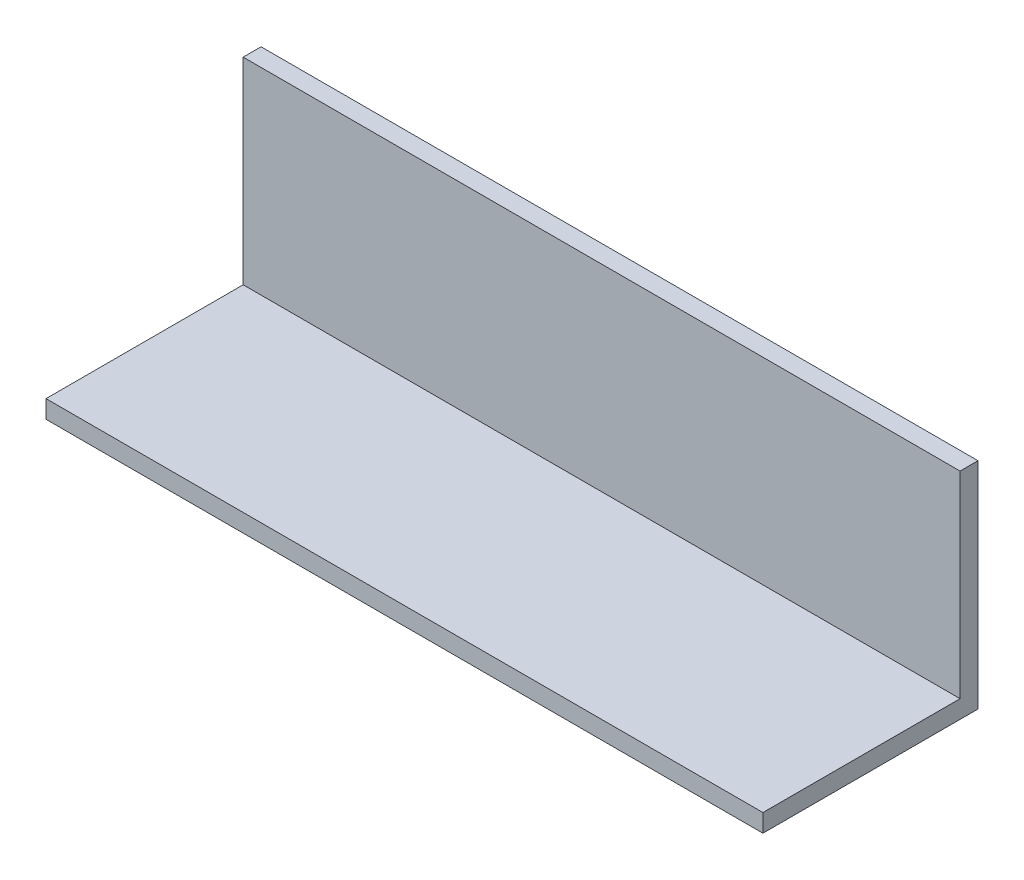
ISO-10303-21;
HEADER;
FILE_DESCRIPTION(('STEP AP214'),'2;1');
FILE_NAME('part.step','',(''),(''),'','','');
FILE_SCHEMA(('AUTOMOTIVE_DESIGN { 1 0 10303 214 1 1 1 1 }'));
ENDSEC;
DATA;
#1=APPLICATION_CONTEXT('core data for automotive mechanical design processes');
#2=APPLICATION_PROTOCOL_DEFINITION('international standard','automotive_design',2000,#1);
#3=PRODUCT_CONTEXT('',#1,'mechanical');
#4=PRODUCT('Part','Part','',(#3));
#5=PRODUCT_RELATED_PRODUCT_CATEGORY('part','',(#4));
#6=PRODUCT_DEFINITION_FORMATION('','',#4);
#7=PRODUCT_DEFINITION_CONTEXT('part definition',#1,'design');
#8=PRODUCT_DEFINITION('design','',#6,#7);
#9=PRODUCT_DEFINITION_SHAPE('','',#8);
#10=(LENGTH_UNIT() NAMED_UNIT(*) SI_UNIT(.MILLI.,.METRE.));
#11=(NAMED_UNIT(*) PLANE_ANGLE_UNIT() SI_UNIT($,.RADIAN.));
#12=(NAMED_UNIT(*) SI_UNIT($,.STERADIAN.) SOLID_ANGLE_UNIT());
#13=UNCERTAINTY_MEASURE_WITH_UNIT(LENGTH_MEASURE(1.E-05),#10,'distance_accuracy_value','');
#14=(GEOMETRIC_REPRESENTATION_CONTEXT(3) GLOBAL_UNCERTAINTY_ASSIGNED_CONTEXT((#13)) GLOBAL_UNIT_ASSIGNED_CONTEXT((#10,
#11,#12)) REPRESENTATION_CONTEXT('',''));
#15=CARTESIAN_POINT('',(0.,0.,0.));
#16=DIRECTION('',(0.,0.,1.));
#17=DIRECTION('',(1.,0.,0.));
#18=AXIS2_PLACEMENT_3D('',#15,#16,#17);
#19=CARTESIAN_POINT('',(-1.846,0.71175,38.1));
#20=DIRECTION('',(0.,-1.,0.));
#21=DIRECTION('',(0.,0.,-1.));
#22=AXIS2_PLACEMENT_3D('',#19,#20,#21);
#23=PLANE('',#22);
#24=DIRECTION('',(-1.,0.,0.));
#25=VECTOR('',#24,1.);
#26=CARTESIAN_POINT('',(-1.846,0.71175,3.175));
#27=LINE('',#26,#25);
#28=CARTESIAN_POINT('',(125.154,0.71175,3.175));
#29=VERTEX_POINT('',#28);
#30=CARTESIAN_POINT('',(-1.846,0.71175,3.175));
#31=VERTEX_POINT('',#30);
#32=EDGE_CURVE('E138',#29,#31,#27,.T.);
#33=ORIENTED_EDGE('',*,*,#32,.F.);
#34=DIRECTION('',(0.,0.,-1.));
#35=VECTOR('',#34,1.);
#36=CARTESIAN_POINT('',(125.154,0.71175,38.1));
#37=LINE('',#36,#35);
#38=CARTESIAN_POINT('',(125.154,0.71175,0.));
#39=VERTEX_POINT('',#38);
#40=EDGE_CURVE('E95',#29,#39,#37,.T.);
#41=ORIENTED_EDGE('',*,*,#40,.T.);
#42=DIRECTION('',(-1.,0.,0.));
#43=VECTOR('',#42,1.);
#44=CARTESIAN_POINT('',(-1.846,0.71175,0.));
#45=LINE('',#44,#43);
#46=CARTESIAN_POINT('',(-1.846,0.71175,0.));
#47=VERTEX_POINT('',#46);
#48=EDGE_CURVE('E99',#39,#47,#45,.T.);
#49=ORIENTED_EDGE('',*,*,#48,.T.);
#50=DIRECTION('',(0.,0.,-1.));
#51=VECTOR('',#50,1.);
#52=CARTESIAN_POINT('',(-1.846,0.71175,38.1));
#53=LINE('',#52,#51);
#54=EDGE_CURVE('E84',#31,#47,#53,.T.);
#55=ORIENTED_EDGE('',*,*,#54,.F.);
#56=EDGE_LOOP('',(#33,#41,#49,#55));
#57=FACE_BOUND('',#56,.T.);
#58=ADVANCED_FACE('F39',(#57),#23,.F.);
#59=CARTESIAN_POINT('',(-1.846,0.71175,38.1));
#60=DIRECTION('',(1.,0.,0.));
#61=DIRECTION('',(0.,1.,0.));
#62=AXIS2_PLACEMENT_3D('',#59,#60,#61);
#63=PLANE('',#62);
#64=DIRECTION('',(0.,-1.,0.));
#65=VECTOR('',#64,1.);
#66=CARTESIAN_POINT('',(-1.846,0.71175,38.1));
#67=LINE('',#66,#65);
#68=CARTESIAN_POINT('',(-1.846,-34.21325,38.1));
#69=VERTEX_POINT('',#68);
#70=CARTESIAN_POINT('',(-1.846,-37.38825,38.1));
#71=VERTEX_POINT('',#70);
#72=EDGE_CURVE('E105',#69,#71,#67,.T.);
#73=ORIENTED_EDGE('',*,*,#72,.F.);
#74=DIRECTION('',(0.,0.,1.));
#75=VECTOR('',#74,1.);
#76=CARTESIAN_POINT('',(-1.846,-34.21325,3.175));
#77=LINE('',#76,#75);
#78=CARTESIAN_POINT('',(-1.846,-34.21325,3.175));
#79=VERTEX_POINT('',#78);
#80=EDGE_CURVE('E55',#79,#69,#77,.T.);
#81=ORIENTED_EDGE('',*,*,#80,.F.);
#82=DIRECTION('',(0.,-1.,0.));
#83=VECTOR('',#82,1.);
#84=CARTESIAN_POINT('',(-1.846,0.71175,3.175));
#85=LINE('',#84,#83);
#86=EDGE_CURVE('E91',#31,#79,#85,.T.);
#87=ORIENTED_EDGE('',*,*,#86,.F.);
#88=ORIENTED_EDGE('',*,*,#54,.T.);
#89=DIRECTION('',(0.,-1.,0.));
#90=VECTOR('',#89,1.);
#91=CARTESIAN_POINT('',(-1.846,0.71175,0.));
#92=LINE('',#91,#90);
#93=CARTESIAN_POINT('',(-1.846,-37.38825,0.));
#94=VERTEX_POINT('',#93);
#95=EDGE_CURVE('E89',#47,#94,#92,.T.);
#96=ORIENTED_EDGE('',*,*,#95,.T.);
#97=DIRECTION('',(0.,0.,-1.));
#98=VECTOR('',#97,1.);
#99=CARTESIAN_POINT('',(-1.846,-37.38825,38.1));
#100=LINE('',#99,#98);
#101=EDGE_CURVE('E11',#71,#94,#100,.T.);
#102=ORIENTED_EDGE('',*,*,#101,.F.);
#103=EDGE_LOOP('',(#73,#81,#87,#88,#96,#102));
#104=FACE_BOUND('',#103,.T.);
#105=ADVANCED_FACE('F41',(#104),#63,.F.);
#106=CARTESIAN_POINT('',(-1.846,-37.38825,38.1));
#107=DIRECTION('',(0.,1.,0.));
#108=DIRECTION('',(0.,0.,1.));
#109=AXIS2_PLACEMENT_3D('',#106,#107,#108);
#110=PLANE('',#109);
#111=DIRECTION('',(1.,0.,0.));
#112=VECTOR('',#111,1.);
#113=CARTESIAN_POINT('',(-1.846,-37.38825,0.));
#114=LINE('',#113,#112);
#115=CARTESIAN_POINT('',(125.154,-37.38825,0.));
#116=VERTEX_POINT('',#115);
#117=EDGE_CURVE('E109',#94,#116,#114,.T.);
#118=ORIENTED_EDGE('',*,*,#117,.T.);
#119=DIRECTION('',(0.,0.,-1.));
#120=VECTOR('',#119,1.);
#121=CARTESIAN_POINT('',(125.154,-37.38825,38.1));
#122=LINE('',#121,#120);
#123=CARTESIAN_POINT('',(125.154,-37.38825,38.1));
#124=VERTEX_POINT('',#123);
#125=EDGE_CURVE('E48',#124,#116,#122,.T.);
#126=ORIENTED_EDGE('',*,*,#125,.F.);
#127=DIRECTION('',(1.,0.,0.));
#128=VECTOR('',#127,1.);
#129=CARTESIAN_POINT('',(-1.846,-37.38825,38.1));
#130=LINE('',#129,#128);
#131=EDGE_CURVE('E64',#71,#124,#130,.T.);
#132=ORIENTED_EDGE('',*,*,#131,.F.);
#133=ORIENTED_EDGE('',*,*,#101,.T.);
#134=EDGE_LOOP('',(#118,#126,#132,#133));
#135=FACE_BOUND('',#134,.T.);
#136=ADVANCED_FACE('F131',(#135),#110,.F.);
#137=CARTESIAN_POINT('',(125.154,0.71175,38.1));
#138=DIRECTION('',(-1.,0.,0.));
#139=DIRECTION('',(0.,0.,1.));
#140=AXIS2_PLACEMENT_3D('',#137,#138,#139);
#141=PLANE('',#140);
#142=DIRECTION('',(0.,1.,0.));
#143=VECTOR('',#142,1.);
#144=CARTESIAN_POINT('',(125.154,0.71175,3.175));
#145=LINE('',#144,#143);
#146=CARTESIAN_POINT('',(125.154,-34.21325,3.175));
#147=VERTEX_POINT('',#146);
#148=EDGE_CURVE('E146',#147,#29,#145,.T.);
#149=ORIENTED_EDGE('',*,*,#148,.F.);
#150=DIRECTION('',(0.,0.,1.));
#151=VECTOR('',#150,1.);
#152=CARTESIAN_POINT('',(125.154,-34.21325,3.175));
#153=LINE('',#152,#151);
#154=CARTESIAN_POINT('',(125.154,-34.21325,38.1));
#155=VERTEX_POINT('',#154);
#156=EDGE_CURVE('E111',#147,#155,#153,.T.);
#157=ORIENTED_EDGE('',*,*,#156,.T.);
#158=DIRECTION('',(0.,1.,0.));
#159=VECTOR('',#158,1.);
#160=CARTESIAN_POINT('',(125.154,0.71175,38.1));
#161=LINE('',#160,#159);
#162=EDGE_CURVE('E96',#124,#155,#161,.T.);
#163=ORIENTED_EDGE('',*,*,#162,.F.);
#164=ORIENTED_EDGE('',*,*,#125,.T.);
#165=DIRECTION('',(0.,1.,0.));
#166=VECTOR('',#165,1.);
#167=CARTESIAN_POINT('',(125.154,0.71175,0.));
#168=LINE('',#167,#166);
#169=EDGE_CURVE('E106',#116,#39,#168,.T.);
#170=ORIENTED_EDGE('',*,*,#169,.T.);
#171=ORIENTED_EDGE('',*,*,#40,.F.);
#172=EDGE_LOOP('',(#149,#157,#163,#164,#170,#171));
#173=FACE_BOUND('',#172,.T.);
#174=ADVANCED_FACE('F129',(#173),#141,.F.);
#175=CARTESIAN_POINT('',(0.,0.,38.1));
#176=DIRECTION('',(0.,0.,1.));
#177=DIRECTION('',(1.,0.,0.));
#178=AXIS2_PLACEMENT_3D('',#175,#176,#177);
#179=PLANE('',#178);
#180=DIRECTION('',(1.,0.,0.));
#181=VECTOR('',#180,1.);
#182=CARTESIAN_POINT('',(-1.846,-34.21325,38.1));
#183=LINE('',#182,#181);
#184=EDGE_CURVE('E140',#69,#155,#183,.T.);
#185=ORIENTED_EDGE('',*,*,#184,.F.);
#186=ORIENTED_EDGE('',*,*,#72,.T.);
#187=ORIENTED_EDGE('',*,*,#131,.T.);
#188=ORIENTED_EDGE('',*,*,#162,.T.);
#189=EDGE_LOOP('',(#185,#186,#187,#188));
#190=FACE_BOUND('',#189,.T.);
#191=ADVANCED_FACE('F165',(#190),#179,.T.);
#192=CARTESIAN_POINT('',(0.,0.,0.));
#193=DIRECTION('',(0.,0.,1.));
#194=DIRECTION('',(1.,0.,0.));
#195=AXIS2_PLACEMENT_3D('',#192,#193,#194);
#196=PLANE('',#195);
#197=ORIENTED_EDGE('',*,*,#95,.F.);
#198=ORIENTED_EDGE('',*,*,#48,.F.);
#199=ORIENTED_EDGE('',*,*,#169,.F.);
#200=ORIENTED_EDGE('',*,*,#117,.F.);
#201=EDGE_LOOP('',(#197,#198,#199,#200));
#202=FACE_BOUND('',#201,.T.);
#203=ADVANCED_FACE('F108',(#202),#196,.F.);
#204=CARTESIAN_POINT('',(-1.846,-34.21325,3.175));
#205=DIRECTION('',(0.,-1.,0.));
#206=DIRECTION('',(0.,0.,-1.));
#207=AXIS2_PLACEMENT_3D('',#204,#205,#206);
#208=PLANE('',#207);
#209=ORIENTED_EDGE('',*,*,#184,.T.);
#210=ORIENTED_EDGE('',*,*,#156,.F.);
#211=DIRECTION('',(1.,0.,0.));
#212=VECTOR('',#211,1.);
#213=CARTESIAN_POINT('',(-1.846,-34.21325,3.175));
#214=LINE('',#213,#212);
#215=EDGE_CURVE('E150',#79,#147,#214,.T.);
#216=ORIENTED_EDGE('',*,*,#215,.F.);
#217=ORIENTED_EDGE('',*,*,#80,.T.);
#218=EDGE_LOOP('',(#209,#210,#216,#217));
#219=FACE_BOUND('',#218,.T.);
#220=ADVANCED_FACE('F167',(#219),#208,.F.);
#221=CARTESIAN_POINT('',(0.,0.,3.175));
#222=DIRECTION('',(0.,0.,1.));
#223=DIRECTION('',(1.,0.,0.));
#224=AXIS2_PLACEMENT_3D('',#221,#222,#223);
#225=PLANE('',#224);
#226=ORIENTED_EDGE('',*,*,#86,.T.);
#227=ORIENTED_EDGE('',*,*,#215,.T.);
#228=ORIENTED_EDGE('',*,*,#148,.T.);
#229=ORIENTED_EDGE('',*,*,#32,.T.);
#230=EDGE_LOOP('',(#226,#227,#228,#229));
#231=FACE_BOUND('',#230,.T.);
#232=ADVANCED_FACE('F156',(#231),#225,.T.);
#233=CLOSED_SHELL('',(#58,#105,#136,#174,#191,#203,#220,#232));
#234=MANIFOLD_SOLID_BREP('B2',#233);
#235=ADVANCED_BREP_SHAPE_REPRESENTATION('',(#18,#234),#14);
#236=SHAPE_DEFINITION_REPRESENTATION(#9,#235);
ENDSEC;
END-ISO-10303-21;
